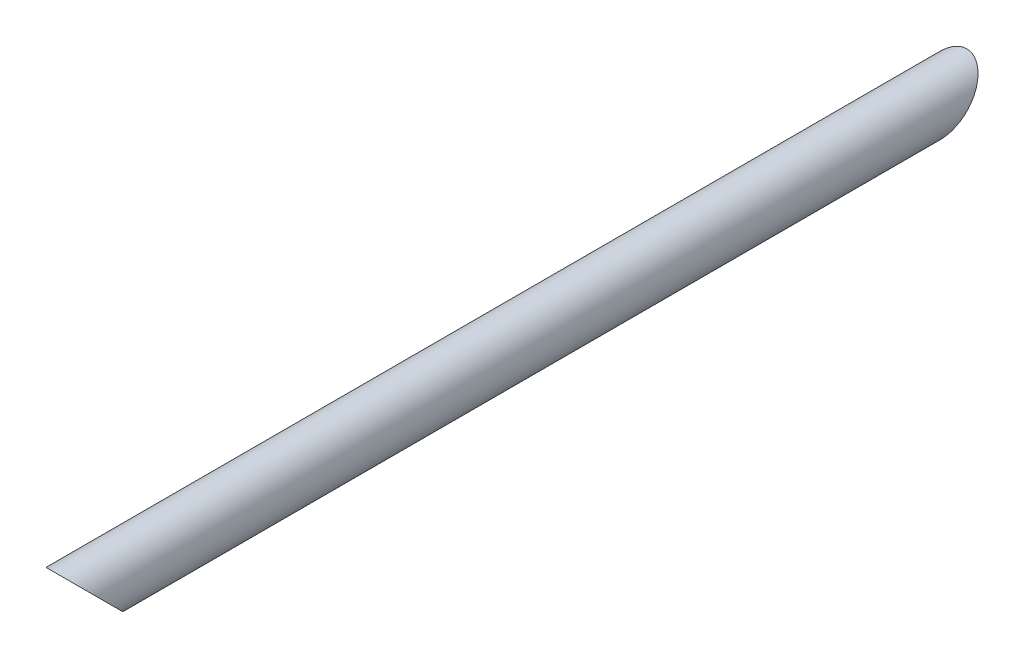
ISO-10303-21;
HEADER;
FILE_DESCRIPTION(('STEP AP214'),'2;1');
FILE_NAME('part.step','',(''),(''),'','','');
FILE_SCHEMA(('AUTOMOTIVE_DESIGN { 1 0 10303 214 1 1 1 1 }'));
ENDSEC;
DATA;
#1=APPLICATION_CONTEXT('core data for automotive mechanical design processes');
#2=APPLICATION_PROTOCOL_DEFINITION('international standard','automotive_design',2000,#1);
#3=PRODUCT_CONTEXT('',#1,'mechanical');
#4=PRODUCT('Part','Part','',(#3));
#5=PRODUCT_RELATED_PRODUCT_CATEGORY('part','',(#4));
#6=PRODUCT_DEFINITION_FORMATION('','',#4);
#7=PRODUCT_DEFINITION_CONTEXT('part definition',#1,'design');
#8=PRODUCT_DEFINITION('design','',#6,#7);
#9=PRODUCT_DEFINITION_SHAPE('','',#8);
#10=(LENGTH_UNIT() NAMED_UNIT(*) SI_UNIT(.MILLI.,.METRE.));
#11=(NAMED_UNIT(*) PLANE_ANGLE_UNIT() SI_UNIT($,.RADIAN.));
#12=(NAMED_UNIT(*) SI_UNIT($,.STERADIAN.) SOLID_ANGLE_UNIT());
#13=UNCERTAINTY_MEASURE_WITH_UNIT(LENGTH_MEASURE(1.E-05),#10,'distance_accuracy_value','');
#14=(GEOMETRIC_REPRESENTATION_CONTEXT(3) GLOBAL_UNCERTAINTY_ASSIGNED_CONTEXT((#13)) GLOBAL_UNIT_ASSIGNED_CONTEXT((#10,
#11,#12)) REPRESENTATION_CONTEXT('',''));
#15=CARTESIAN_POINT('',(0.,0.,0.));
#16=DIRECTION('',(0.,0.,1.));
#17=DIRECTION('',(1.,0.,0.));
#18=AXIS2_PLACEMENT_3D('',#15,#16,#17);
#19=CARTESIAN_POINT('',(0.,350.,199.999999999996));
#20=DIRECTION('',(0.,0.,-1.));
#21=DIRECTION('',(-1.,0.,0.));
#22=AXIS2_PLACEMENT_3D('',#19,#20,#21);
#23=CYLINDRICAL_SURFACE('',#22,9.65);
#24=CARTESIAN_POINT('',(-1.68322387278375E-13,350.,-200.000000000003));
#25=DIRECTION('',(0.,-0.707106781186548,-0.707106781186548));
#26=DIRECTION('',(0.,0.707106781186548,-0.707106781186548));
#27=AXIS2_PLACEMENT_3D('',#24,#25,#26);
#28=ELLIPSE('',#27,13.6471608769004,9.65);
#29=CARTESIAN_POINT('',(-1.72278539361821E-13,359.65,-209.650000000003));
#30=VERTEX_POINT('',#29);
#31=EDGE_CURVE('E58',#30,#30,#28,.T.);
#32=ORIENTED_EDGE('',*,*,#31,.T.);
#33=EDGE_LOOP('',(#32));
#34=FACE_BOUND('',#33,.T.);
#35=CARTESIAN_POINT('',(0.,350.,199.999999999996));
#36=DIRECTION('',(0.,-0.707106781186544,0.707106781186551));
#37=DIRECTION('',(0.,-0.707106781186551,-0.707106781186544));
#38=AXIS2_PLACEMENT_3D('',#35,#36,#37);
#39=ELLIPSE('',#38,13.6471608769003,9.65);
#40=CARTESIAN_POINT('',(0.,340.35,190.349999999997));
#41=VERTEX_POINT('',#40);
#42=EDGE_CURVE('E44',#41,#41,#39,.T.);
#43=ORIENTED_EDGE('',*,*,#42,.T.);
#44=EDGE_LOOP('',(#43));
#45=FACE_BOUND('',#44,.T.);
#46=ADVANCED_FACE('F40',(#34,#45),#23,.F.);
#47=CARTESIAN_POINT('',(0.,350.,199.999999999996));
#48=DIRECTION('',(0.,0.,-1.));
#49=DIRECTION('',(-1.,0.,0.));
#50=AXIS2_PLACEMENT_3D('',#47,#48,#49);
#51=CYLINDRICAL_SURFACE('',#50,12.7);
#52=CARTESIAN_POINT('',(-1.68322387278375E-13,350.,-200.000000000003));
#53=DIRECTION('',(0.,-0.707106781186548,-0.707106781186548));
#54=DIRECTION('',(0.,0.707106781186548,-0.707106781186548));
#55=AXIS2_PLACEMENT_3D('',#52,#53,#54);
#56=ELLIPSE('',#55,17.9605122421383,12.7);
#57=CARTESIAN_POINT('',(-1.73528929398557E-13,362.7,-212.700000000003));
#58=VERTEX_POINT('',#57);
#59=EDGE_CURVE('E49',#58,#58,#56,.T.);
#60=ORIENTED_EDGE('',*,*,#59,.F.);
#61=EDGE_LOOP('',(#60));
#62=FACE_BOUND('',#61,.T.);
#63=CARTESIAN_POINT('',(0.,350.,199.999999999996));
#64=DIRECTION('',(0.,-0.707106781186544,0.707106781186551));
#65=DIRECTION('',(0.,-0.707106781186551,-0.707106781186544));
#66=AXIS2_PLACEMENT_3D('',#63,#64,#65);
#67=ELLIPSE('',#66,17.9605122421382,12.7);
#68=CARTESIAN_POINT('',(0.,337.3,187.299999999997));
#69=VERTEX_POINT('',#68);
#70=EDGE_CURVE('E10',#69,#69,#67,.T.);
#71=ORIENTED_EDGE('',*,*,#70,.F.);
#72=EDGE_LOOP('',(#71));
#73=FACE_BOUND('',#72,.T.);
#74=ADVANCED_FACE('F74',(#62,#73),#51,.T.);
#75=CARTESIAN_POINT('',(-1.67164090169531E-13,350.,-200.000000000003));
#76=DIRECTION('',(0.,-0.707106781186548,-0.707106781186548));
#77=DIRECTION('',(0.,0.707106781186548,-0.707106781186548));
#78=AXIS2_PLACEMENT_3D('',#75,#76,#77);
#79=PLANE('',#78);
#80=ORIENTED_EDGE('',*,*,#31,.F.);
#81=EDGE_LOOP('',(#80));
#82=FACE_BOUND('',#81,.T.);
#83=ORIENTED_EDGE('',*,*,#59,.T.);
#84=EDGE_LOOP('',(#83));
#85=FACE_BOUND('',#84,.T.);
#86=ADVANCED_FACE('F70',(#82,#85),#79,.T.);
#87=CARTESIAN_POINT('',(0.,350.,199.999999999996));
#88=DIRECTION('',(0.,-0.707106781186544,0.707106781186551));
#89=DIRECTION('',(0.,-0.707106781186551,-0.707106781186544));
#90=AXIS2_PLACEMENT_3D('',#87,#88,#89);
#91=PLANE('',#90);
#92=ORIENTED_EDGE('',*,*,#42,.F.);
#93=EDGE_LOOP('',(#92));
#94=FACE_BOUND('',#93,.T.);
#95=ORIENTED_EDGE('',*,*,#70,.T.);
#96=EDGE_LOOP('',(#95));
#97=FACE_BOUND('',#96,.T.);
#98=ADVANCED_FACE('F42',(#94,#97),#91,.T.);
#99=CLOSED_SHELL('',(#46,#74,#86,#98));
#100=MANIFOLD_SOLID_BREP('B2',#99);
#101=ADVANCED_BREP_SHAPE_REPRESENTATION('',(#18,#100),#14);
#102=SHAPE_DEFINITION_REPRESENTATION(#9,#101);
ENDSEC;
END-ISO-10303-21;
